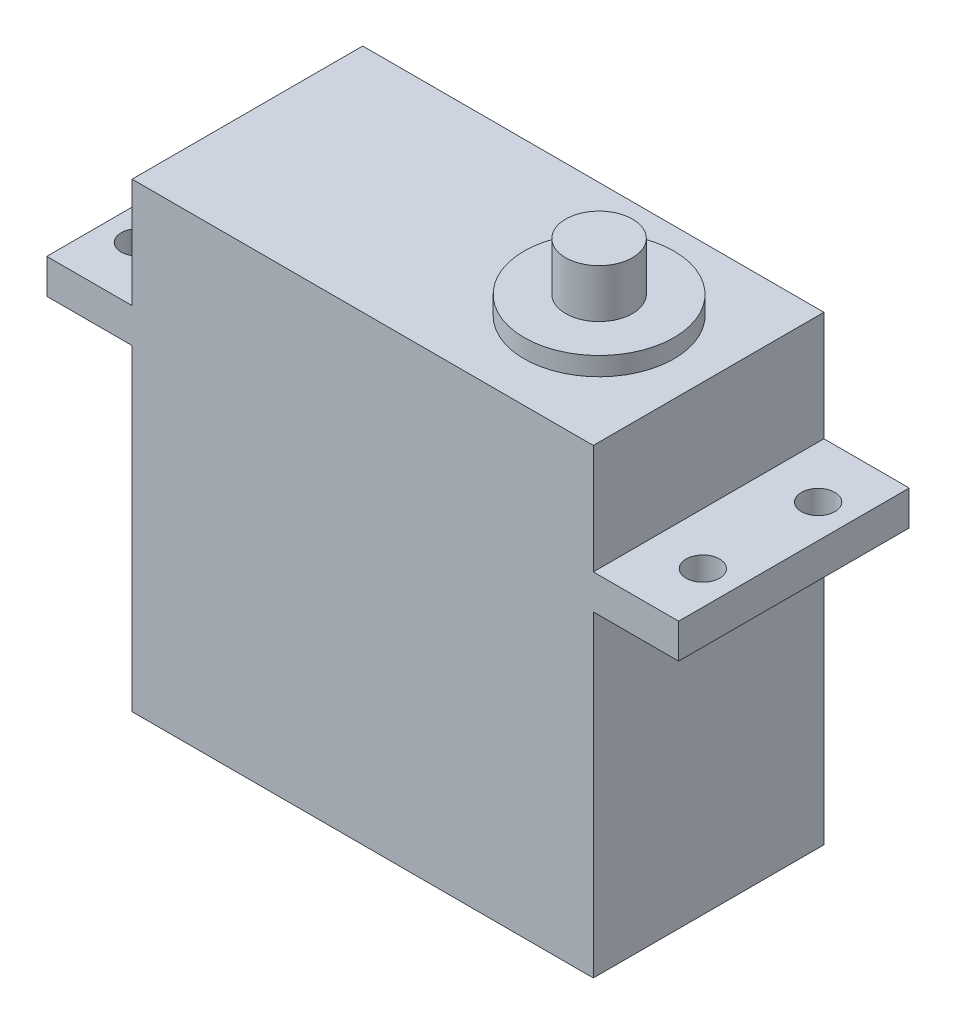
ISO-10303-21;
HEADER;
FILE_DESCRIPTION(('STEP AP214'),'2;1');
FILE_NAME('part.step','',(''),(''),'','','');
FILE_SCHEMA(('AUTOMOTIVE_DESIGN { 1 0 10303 214 1 1 1 1 }'));
ENDSEC;
DATA;
#1=APPLICATION_CONTEXT('core data for automotive mechanical design processes');
#2=APPLICATION_PROTOCOL_DEFINITION('international standard','automotive_design',2000,#1);
#3=PRODUCT_CONTEXT('',#1,'mechanical');
#4=PRODUCT('Part','Part','',(#3));
#5=PRODUCT_RELATED_PRODUCT_CATEGORY('part','',(#4));
#6=PRODUCT_DEFINITION_FORMATION('','',#4);
#7=PRODUCT_DEFINITION_CONTEXT('part definition',#1,'design');
#8=PRODUCT_DEFINITION('design','',#6,#7);
#9=PRODUCT_DEFINITION_SHAPE('','',#8);
#10=(LENGTH_UNIT() NAMED_UNIT(*) SI_UNIT(.MILLI.,.METRE.));
#11=(NAMED_UNIT(*) PLANE_ANGLE_UNIT() SI_UNIT($,.RADIAN.));
#12=(NAMED_UNIT(*) SI_UNIT($,.STERADIAN.) SOLID_ANGLE_UNIT());
#13=UNCERTAINTY_MEASURE_WITH_UNIT(LENGTH_MEASURE(1.E-05),#10,'distance_accuracy_value','');
#14=(GEOMETRIC_REPRESENTATION_CONTEXT(3) GLOBAL_UNCERTAINTY_ASSIGNED_CONTEXT((#13)) GLOBAL_UNIT_ASSIGNED_CONTEXT((#10,
#11,#12)) REPRESENTATION_CONTEXT('',''));
#15=CARTESIAN_POINT('',(0.,0.,0.));
#16=DIRECTION('',(0.,0.,1.));
#17=DIRECTION('',(1.,0.,0.));
#18=AXIS2_PLACEMENT_3D('',#15,#16,#17);
#19=CARTESIAN_POINT('',(-20.,40.,10.));
#20=DIRECTION('',(1.,0.,0.));
#21=DIRECTION('',(0.,0.,-1.));
#22=AXIS2_PLACEMENT_3D('',#19,#20,#21);
#23=PLANE('',#22);
#24=DIRECTION('',(0.,-1.,0.));
#25=VECTOR('',#24,1.);
#26=CARTESIAN_POINT('',(-20.,40.,10.));
#27=LINE('',#26,#25);
#28=CARTESIAN_POINT('',(-20.,27.5,10.));
#29=VERTEX_POINT('',#28);
#30=CARTESIAN_POINT('',(-20.,0.,10.));
#31=VERTEX_POINT('',#30);
#32=EDGE_CURVE('E211',#29,#31,#27,.T.);
#33=ORIENTED_EDGE('',*,*,#32,.F.);
#34=DIRECTION('',(0.,0.,-1.));
#35=VECTOR('',#34,1.);
#36=CARTESIAN_POINT('',(-20.,27.5,10.));
#37=LINE('',#36,#35);
#38=CARTESIAN_POINT('',(-20.,27.5,-10.));
#39=VERTEX_POINT('',#38);
#40=EDGE_CURVE('E144',#29,#39,#37,.T.);
#41=ORIENTED_EDGE('',*,*,#40,.T.);
#42=DIRECTION('',(0.,-1.,0.));
#43=VECTOR('',#42,1.);
#44=CARTESIAN_POINT('',(-20.,40.,-10.));
#45=LINE('',#44,#43);
#46=CARTESIAN_POINT('',(-20.,0.,-10.));
#47=VERTEX_POINT('',#46);
#48=EDGE_CURVE('E213',#39,#47,#45,.T.);
#49=ORIENTED_EDGE('',*,*,#48,.T.);
#50=DIRECTION('',(0.,0.,1.));
#51=VECTOR('',#50,1.);
#52=CARTESIAN_POINT('',(-20.,0.,10.));
#53=LINE('',#52,#51);
#54=EDGE_CURVE('E205',#47,#31,#53,.T.);
#55=ORIENTED_EDGE('',*,*,#54,.T.);
#56=EDGE_LOOP('',(#33,#41,#49,#55));
#57=FACE_BOUND('',#56,.T.);
#58=ADVANCED_FACE('F34',(#57),#23,.F.);
#59=CARTESIAN_POINT('',(20.,40.,10.));
#60=DIRECTION('',(-1.,0.,0.));
#61=DIRECTION('',(0.,0.,1.));
#62=AXIS2_PLACEMENT_3D('',#59,#60,#61);
#63=PLANE('',#62);
#64=DIRECTION('',(0.,0.,1.));
#65=VECTOR('',#64,1.);
#66=CARTESIAN_POINT('',(20.,30.5,10.));
#67=LINE('',#66,#65);
#68=CARTESIAN_POINT('',(20.,30.5,-10.));
#69=VERTEX_POINT('',#68);
#70=CARTESIAN_POINT('',(20.,30.5,10.));
#71=VERTEX_POINT('',#70);
#72=EDGE_CURVE('E167',#69,#71,#67,.T.);
#73=ORIENTED_EDGE('',*,*,#72,.F.);
#74=DIRECTION('',(0.,-1.,0.));
#75=VECTOR('',#74,1.);
#76=CARTESIAN_POINT('',(20.,40.,-10.));
#77=LINE('',#76,#75);
#78=CARTESIAN_POINT('',(20.,40.,-10.));
#79=VERTEX_POINT('',#78);
#80=EDGE_CURVE('E43',#79,#69,#77,.T.);
#81=ORIENTED_EDGE('',*,*,#80,.F.);
#82=DIRECTION('',(0.,0.,-1.));
#83=VECTOR('',#82,1.);
#84=CARTESIAN_POINT('',(20.,40.,10.));
#85=LINE('',#84,#83);
#86=CARTESIAN_POINT('',(20.,40.,10.));
#87=VERTEX_POINT('',#86);
#88=EDGE_CURVE('E189',#87,#79,#85,.T.);
#89=ORIENTED_EDGE('',*,*,#88,.F.);
#90=DIRECTION('',(0.,-1.,0.));
#91=VECTOR('',#90,1.);
#92=CARTESIAN_POINT('',(20.,40.,10.));
#93=LINE('',#92,#91);
#94=EDGE_CURVE('E209',#87,#71,#93,.T.);
#95=ORIENTED_EDGE('',*,*,#94,.T.);
#96=EDGE_LOOP('',(#73,#81,#89,#95));
#97=FACE_BOUND('',#96,.T.);
#98=ADVANCED_FACE('F36',(#97),#63,.F.);
#99=DIRECTION('',(0.,0.,-1.));
#100=VECTOR('',#99,1.);
#101=CARTESIAN_POINT('',(20.,27.5,10.));
#102=LINE('',#101,#100);
#103=CARTESIAN_POINT('',(20.,27.5,10.));
#104=VERTEX_POINT('',#103);
#105=CARTESIAN_POINT('',(20.,27.5,-10.));
#106=VERTEX_POINT('',#105);
#107=EDGE_CURVE('E59',#104,#106,#102,.T.);
#108=ORIENTED_EDGE('',*,*,#107,.F.);
#109=CARTESIAN_POINT('',(20.,0.,10.));
#110=VERTEX_POINT('',#109);
#111=EDGE_CURVE('E199',#104,#110,#93,.T.);
#112=ORIENTED_EDGE('',*,*,#111,.T.);
#113=DIRECTION('',(0.,0.,-1.));
#114=VECTOR('',#113,1.);
#115=CARTESIAN_POINT('',(20.,0.,10.));
#116=LINE('',#115,#114);
#117=CARTESIAN_POINT('',(20.,0.,-10.));
#118=VERTEX_POINT('',#117);
#119=EDGE_CURVE('E188',#110,#118,#116,.T.);
#120=ORIENTED_EDGE('',*,*,#119,.T.);
#121=EDGE_CURVE('E217',#106,#118,#77,.T.);
#122=ORIENTED_EDGE('',*,*,#121,.F.);
#123=EDGE_LOOP('',(#108,#112,#120,#122));
#124=FACE_BOUND('',#123,.T.);
#125=ADVANCED_FACE('F276',(#124),#63,.F.);
#126=CARTESIAN_POINT('',(-20.,40.,-10.));
#127=DIRECTION('',(0.,0.,1.));
#128=DIRECTION('',(1.,0.,0.));
#129=AXIS2_PLACEMENT_3D('',#126,#127,#128);
#130=PLANE('',#129);
#131=DIRECTION('',(-1.,0.,0.));
#132=VECTOR('',#131,1.);
#133=CARTESIAN_POINT('',(-20.,0.,-10.));
#134=LINE('',#133,#132);
#135=EDGE_CURVE('E202',#118,#47,#134,.T.);
#136=ORIENTED_EDGE('',*,*,#135,.T.);
#137=ORIENTED_EDGE('',*,*,#48,.F.);
#138=DIRECTION('',(1.,0.,0.));
#139=VECTOR('',#138,1.);
#140=CARTESIAN_POINT('',(-27.4,27.5,-10.));
#141=LINE('',#140,#139);
#142=CARTESIAN_POINT('',(-27.4,27.5,-10.));
#143=VERTEX_POINT('',#142);
#144=EDGE_CURVE('E160',#143,#39,#141,.T.);
#145=ORIENTED_EDGE('',*,*,#144,.F.);
#146=DIRECTION('',(0.,1.,0.));
#147=VECTOR('',#146,1.);
#148=CARTESIAN_POINT('',(-27.4,30.5,-10.));
#149=LINE('',#148,#147);
#150=CARTESIAN_POINT('',(-27.4,30.5,-10.));
#151=VERTEX_POINT('',#150);
#152=EDGE_CURVE('E147',#143,#151,#149,.T.);
#153=ORIENTED_EDGE('',*,*,#152,.T.);
#154=DIRECTION('',(1.,0.,0.));
#155=VECTOR('',#154,1.);
#156=CARTESIAN_POINT('',(-27.4,30.5,-10.));
#157=LINE('',#156,#155);
#158=CARTESIAN_POINT('',(-20.,30.5,-10.));
#159=VERTEX_POINT('',#158);
#160=EDGE_CURVE('E134',#151,#159,#157,.T.);
#161=ORIENTED_EDGE('',*,*,#160,.T.);
#162=CARTESIAN_POINT('',(-20.,40.,-10.));
#163=VERTEX_POINT('',#162);
#164=EDGE_CURVE('E214',#163,#159,#45,.T.);
#165=ORIENTED_EDGE('',*,*,#164,.F.);
#166=DIRECTION('',(-1.,0.,0.));
#167=VECTOR('',#166,1.);
#168=CARTESIAN_POINT('',(-20.,40.,-10.));
#169=LINE('',#168,#167);
#170=EDGE_CURVE('E192',#79,#163,#169,.T.);
#171=ORIENTED_EDGE('',*,*,#170,.F.);
#172=ORIENTED_EDGE('',*,*,#80,.T.);
#173=DIRECTION('',(-1.,0.,0.));
#174=VECTOR('',#173,1.);
#175=CARTESIAN_POINT('',(27.4,30.5,-10.));
#176=LINE('',#175,#174);
#177=CARTESIAN_POINT('',(27.4,30.5,-10.));
#178=VERTEX_POINT('',#177);
#179=EDGE_CURVE('E179',#178,#69,#176,.T.);
#180=ORIENTED_EDGE('',*,*,#179,.F.);
#181=DIRECTION('',(0.,1.,0.));
#182=VECTOR('',#181,1.);
#183=CARTESIAN_POINT('',(27.4,30.5,-10.));
#184=LINE('',#183,#182);
#185=CARTESIAN_POINT('',(27.4,27.5,-10.));
#186=VERTEX_POINT('',#185);
#187=EDGE_CURVE('E169',#186,#178,#184,.T.);
#188=ORIENTED_EDGE('',*,*,#187,.F.);
#189=DIRECTION('',(-1.,0.,0.));
#190=VECTOR('',#189,1.);
#191=CARTESIAN_POINT('',(27.4,27.5,-10.));
#192=LINE('',#191,#190);
#193=EDGE_CURVE('E182',#186,#106,#192,.T.);
#194=ORIENTED_EDGE('',*,*,#193,.T.);
#195=ORIENTED_EDGE('',*,*,#121,.T.);
#196=EDGE_LOOP('',(#136,#137,#145,#153,#161,#165,#171,#172,#180,#188,#194,#195));
#197=FACE_BOUND('',#196,.T.);
#198=ADVANCED_FACE('F281',(#197),#130,.F.);
#199=ORIENTED_EDGE('',*,*,#164,.T.);
#200=DIRECTION('',(0.,0.,1.));
#201=VECTOR('',#200,1.);
#202=CARTESIAN_POINT('',(-20.,30.5,10.));
#203=LINE('',#202,#201);
#204=CARTESIAN_POINT('',(-20.,30.5,10.));
#205=VERTEX_POINT('',#204);
#206=EDGE_CURVE('E154',#159,#205,#203,.T.);
#207=ORIENTED_EDGE('',*,*,#206,.T.);
#208=CARTESIAN_POINT('',(-20.,40.,10.));
#209=VERTEX_POINT('',#208);
#210=EDGE_CURVE('E133',#209,#205,#27,.T.);
#211=ORIENTED_EDGE('',*,*,#210,.F.);
#212=DIRECTION('',(0.,0.,1.));
#213=VECTOR('',#212,1.);
#214=CARTESIAN_POINT('',(-20.,40.,10.));
#215=LINE('',#214,#213);
#216=EDGE_CURVE('E195',#163,#209,#215,.T.);
#217=ORIENTED_EDGE('',*,*,#216,.F.);
#218=EDGE_LOOP('',(#199,#207,#211,#217));
#219=FACE_BOUND('',#218,.T.);
#220=ADVANCED_FACE('F272',(#219),#23,.F.);
#221=CARTESIAN_POINT('',(-20.,40.,10.));
#222=DIRECTION('',(0.,0.,-1.));
#223=DIRECTION('',(-1.,0.,0.));
#224=AXIS2_PLACEMENT_3D('',#221,#222,#223);
#225=PLANE('',#224);
#226=DIRECTION('',(1.,0.,0.));
#227=VECTOR('',#226,1.);
#228=CARTESIAN_POINT('',(-20.,0.,10.));
#229=LINE('',#228,#227);
#230=EDGE_CURVE('E193',#31,#110,#229,.T.);
#231=ORIENTED_EDGE('',*,*,#230,.T.);
#232=ORIENTED_EDGE('',*,*,#111,.F.);
#233=DIRECTION('',(-1.,0.,0.));
#234=VECTOR('',#233,1.);
#235=CARTESIAN_POINT('',(27.4,27.5,10.));
#236=LINE('',#235,#234);
#237=CARTESIAN_POINT('',(27.4,27.5,10.));
#238=VERTEX_POINT('',#237);
#239=EDGE_CURVE('E185',#238,#104,#236,.T.);
#240=ORIENTED_EDGE('',*,*,#239,.F.);
#241=DIRECTION('',(0.,-1.,0.));
#242=VECTOR('',#241,1.);
#243=CARTESIAN_POINT('',(27.4,30.5,10.));
#244=LINE('',#243,#242);
#245=CARTESIAN_POINT('',(27.4,30.5,10.));
#246=VERTEX_POINT('',#245);
#247=EDGE_CURVE('E163',#246,#238,#244,.T.);
#248=ORIENTED_EDGE('',*,*,#247,.F.);
#249=DIRECTION('',(-1.,0.,0.));
#250=VECTOR('',#249,1.);
#251=CARTESIAN_POINT('',(27.4,30.5,10.));
#252=LINE('',#251,#250);
#253=EDGE_CURVE('E173',#246,#71,#252,.T.);
#254=ORIENTED_EDGE('',*,*,#253,.T.);
#255=ORIENTED_EDGE('',*,*,#94,.F.);
#256=DIRECTION('',(1.,0.,0.));
#257=VECTOR('',#256,1.);
#258=CARTESIAN_POINT('',(-20.,40.,10.));
#259=LINE('',#258,#257);
#260=EDGE_CURVE('E197',#209,#87,#259,.T.);
#261=ORIENTED_EDGE('',*,*,#260,.F.);
#262=ORIENTED_EDGE('',*,*,#210,.T.);
#263=DIRECTION('',(1.,0.,0.));
#264=VECTOR('',#263,1.);
#265=CARTESIAN_POINT('',(-27.4,30.5,10.));
#266=LINE('',#265,#264);
#267=CARTESIAN_POINT('',(-27.4,30.5,10.));
#268=VERTEX_POINT('',#267);
#269=EDGE_CURVE('E51',#268,#205,#266,.T.);
#270=ORIENTED_EDGE('',*,*,#269,.F.);
#271=DIRECTION('',(0.,-1.,0.));
#272=VECTOR('',#271,1.);
#273=CARTESIAN_POINT('',(-27.4,30.5,10.));
#274=LINE('',#273,#272);
#275=CARTESIAN_POINT('',(-27.4,27.5,10.));
#276=VERTEX_POINT('',#275);
#277=EDGE_CURVE('E129',#268,#276,#274,.T.);
#278=ORIENTED_EDGE('',*,*,#277,.T.);
#279=DIRECTION('',(1.,0.,0.));
#280=VECTOR('',#279,1.);
#281=CARTESIAN_POINT('',(-27.4,27.5,10.));
#282=LINE('',#281,#280);
#283=EDGE_CURVE('E153',#276,#29,#282,.T.);
#284=ORIENTED_EDGE('',*,*,#283,.T.);
#285=ORIENTED_EDGE('',*,*,#32,.T.);
#286=EDGE_LOOP('',(#231,#232,#240,#248,#254,#255,#261,#262,#270,#278,#284,#285));
#287=FACE_BOUND('',#286,.T.);
#288=ADVANCED_FACE('F128',(#287),#225,.F.);
#289=CARTESIAN_POINT('',(0.,40.,0.));
#290=DIRECTION('',(0.,-1.,0.));
#291=DIRECTION('',(0.,0.,-1.));
#292=AXIS2_PLACEMENT_3D('',#289,#290,#291);
#293=PLANE('',#292);
#294=CARTESIAN_POINT('',(10.5,40.,0.));
#295=DIRECTION('',(0.,-1.,0.));
#296=DIRECTION('',(0.,0.,-1.));
#297=AXIS2_PLACEMENT_3D('',#294,#295,#296);
#298=CIRCLE('',#297,6.5);
#299=CARTESIAN_POINT('',(10.5,40.,-6.5));
#300=VERTEX_POINT('',#299);
#301=EDGE_CURVE('E11',#300,#300,#298,.F.);
#302=ORIENTED_EDGE('',*,*,#301,.F.);
#303=EDGE_LOOP('',(#302));
#304=FACE_BOUND('',#303,.T.);
#305=ORIENTED_EDGE('',*,*,#88,.T.);
#306=ORIENTED_EDGE('',*,*,#170,.T.);
#307=ORIENTED_EDGE('',*,*,#216,.T.);
#308=ORIENTED_EDGE('',*,*,#260,.T.);
#309=EDGE_LOOP('',(#305,#306,#307,#308));
#310=FACE_BOUND('',#309,.T.);
#311=ADVANCED_FACE('F287',(#304,#310),#293,.F.);
#312=CARTESIAN_POINT('',(0.,0.,0.));
#313=DIRECTION('',(0.,-1.,0.));
#314=DIRECTION('',(0.,0.,-1.));
#315=AXIS2_PLACEMENT_3D('',#312,#313,#314);
#316=PLANE('',#315);
#317=ORIENTED_EDGE('',*,*,#119,.F.);
#318=ORIENTED_EDGE('',*,*,#230,.F.);
#319=ORIENTED_EDGE('',*,*,#54,.F.);
#320=ORIENTED_EDGE('',*,*,#135,.F.);
#321=EDGE_LOOP('',(#317,#318,#319,#320));
#322=FACE_BOUND('',#321,.T.);
#323=ADVANCED_FACE('F300',(#322),#316,.T.);
#324=CARTESIAN_POINT('',(27.4,27.5,10.));
#325=DIRECTION('',(0.,1.,0.));
#326=DIRECTION('',(0.,0.,1.));
#327=AXIS2_PLACEMENT_3D('',#324,#325,#326);
#328=PLANE('',#327);
#329=CARTESIAN_POINT('',(24.5000000000001,27.5,-4.99999999999964));
#330=DIRECTION('',(0.,1.,0.));
#331=DIRECTION('',(0.,0.,1.));
#332=AXIS2_PLACEMENT_3D('',#329,#330,#331);
#333=CIRCLE('',#332,1.45);
#334=CARTESIAN_POINT('',(24.5000000000001,27.5,-3.54999999999965));
#335=VERTEX_POINT('',#334);
#336=EDGE_CURVE('E230',#335,#335,#333,.T.);
#337=ORIENTED_EDGE('',*,*,#336,.T.);
#338=EDGE_LOOP('',(#337));
#339=FACE_BOUND('',#338,.T.);
#340=CARTESIAN_POINT('',(24.5000000000002,27.5,5.00000000000035));
#341=DIRECTION('',(0.,1.,0.));
#342=DIRECTION('',(0.,0.,1.));
#343=AXIS2_PLACEMENT_3D('',#340,#341,#342);
#344=CIRCLE('',#343,1.45);
#345=CARTESIAN_POINT('',(24.5000000000002,27.5,6.45000000000035));
#346=VERTEX_POINT('',#345);
#347=EDGE_CURVE('E245',#346,#346,#344,.T.);
#348=ORIENTED_EDGE('',*,*,#347,.T.);
#349=EDGE_LOOP('',(#348));
#350=FACE_BOUND('',#349,.T.);
#351=ORIENTED_EDGE('',*,*,#107,.T.);
#352=ORIENTED_EDGE('',*,*,#193,.F.);
#353=DIRECTION('',(0.,0.,-1.));
#354=VECTOR('',#353,1.);
#355=CARTESIAN_POINT('',(27.4,27.5,10.));
#356=LINE('',#355,#354);
#357=EDGE_CURVE('E166',#238,#186,#356,.T.);
#358=ORIENTED_EDGE('',*,*,#357,.F.);
#359=ORIENTED_EDGE('',*,*,#239,.T.);
#360=EDGE_LOOP('',(#351,#352,#358,#359));
#361=FACE_BOUND('',#360,.T.);
#362=ADVANCED_FACE('F304',(#339,#350,#361),#328,.F.);
#363=CARTESIAN_POINT('',(27.4,30.5,10.));
#364=DIRECTION('',(0.,-1.,0.));
#365=DIRECTION('',(0.,0.,-1.));
#366=AXIS2_PLACEMENT_3D('',#363,#364,#365);
#367=PLANE('',#366);
#368=CARTESIAN_POINT('',(24.5000000000001,30.5,-4.99999999999964));
#369=DIRECTION('',(0.,1.,0.));
#370=DIRECTION('',(0.,0.,1.));
#371=AXIS2_PLACEMENT_3D('',#368,#369,#370);
#372=CIRCLE('',#371,1.45);
#373=CARTESIAN_POINT('',(24.5000000000001,30.5,-3.54999999999964));
#374=VERTEX_POINT('',#373);
#375=EDGE_CURVE('E225',#374,#374,#372,.T.);
#376=ORIENTED_EDGE('',*,*,#375,.F.);
#377=EDGE_LOOP('',(#376));
#378=FACE_BOUND('',#377,.T.);
#379=CARTESIAN_POINT('',(24.5000000000002,30.5,5.00000000000035));
#380=DIRECTION('',(0.,1.,0.));
#381=DIRECTION('',(0.,0.,1.));
#382=AXIS2_PLACEMENT_3D('',#379,#380,#381);
#383=CIRCLE('',#382,1.45);
#384=CARTESIAN_POINT('',(24.5000000000002,30.5,6.45000000000035));
#385=VERTEX_POINT('',#384);
#386=EDGE_CURVE('E242',#385,#385,#383,.T.);
#387=ORIENTED_EDGE('',*,*,#386,.F.);
#388=EDGE_LOOP('',(#387));
#389=FACE_BOUND('',#388,.T.);
#390=ORIENTED_EDGE('',*,*,#72,.T.);
#391=ORIENTED_EDGE('',*,*,#253,.F.);
#392=DIRECTION('',(0.,0.,1.));
#393=VECTOR('',#392,1.);
#394=CARTESIAN_POINT('',(27.4,30.5,10.));
#395=LINE('',#394,#393);
#396=EDGE_CURVE('E171',#178,#246,#395,.T.);
#397=ORIENTED_EDGE('',*,*,#396,.F.);
#398=ORIENTED_EDGE('',*,*,#179,.T.);
#399=EDGE_LOOP('',(#390,#391,#397,#398));
#400=FACE_BOUND('',#399,.T.);
#401=ADVANCED_FACE('F314',(#378,#389,#400),#367,.F.);
#402=CARTESIAN_POINT('',(27.4,0.,0.));
#403=DIRECTION('',(1.,0.,0.));
#404=DIRECTION('',(0.,0.,-1.));
#405=AXIS2_PLACEMENT_3D('',#402,#403,#404);
#406=PLANE('',#405);
#407=ORIENTED_EDGE('',*,*,#247,.T.);
#408=ORIENTED_EDGE('',*,*,#357,.T.);
#409=ORIENTED_EDGE('',*,*,#187,.T.);
#410=ORIENTED_EDGE('',*,*,#396,.T.);
#411=EDGE_LOOP('',(#407,#408,#409,#410));
#412=FACE_BOUND('',#411,.T.);
#413=ADVANCED_FACE('F308',(#412),#406,.T.);
#414=CARTESIAN_POINT('',(-27.4,30.5,10.));
#415=DIRECTION('',(0.,1.,0.));
#416=DIRECTION('',(0.,0.,1.));
#417=AXIS2_PLACEMENT_3D('',#414,#415,#416);
#418=PLANE('',#417);
#419=CARTESIAN_POINT('',(-24.4999999999999,30.5,-4.99999999999964));
#420=DIRECTION('',(0.,1.,0.));
#421=DIRECTION('',(0.,0.,1.));
#422=AXIS2_PLACEMENT_3D('',#419,#420,#421);
#423=CIRCLE('',#422,1.45);
#424=CARTESIAN_POINT('',(-24.4999999999999,30.5,-3.54999999999964));
#425=VERTEX_POINT('',#424);
#426=EDGE_CURVE('E237',#425,#425,#423,.T.);
#427=ORIENTED_EDGE('',*,*,#426,.F.);
#428=EDGE_LOOP('',(#427));
#429=FACE_BOUND('',#428,.T.);
#430=CARTESIAN_POINT('',(-24.4999999999999,30.5,5.00000000000038));
#431=DIRECTION('',(0.,1.,0.));
#432=DIRECTION('',(0.,0.,1.));
#433=AXIS2_PLACEMENT_3D('',#430,#431,#432);
#434=CIRCLE('',#433,1.45);
#435=CARTESIAN_POINT('',(-24.4999999999999,30.5,6.45000000000038));
#436=VERTEX_POINT('',#435);
#437=EDGE_CURVE('E226',#436,#436,#434,.T.);
#438=ORIENTED_EDGE('',*,*,#437,.F.);
#439=EDGE_LOOP('',(#438));
#440=FACE_BOUND('',#439,.T.);
#441=ORIENTED_EDGE('',*,*,#206,.F.);
#442=ORIENTED_EDGE('',*,*,#160,.F.);
#443=DIRECTION('',(0.,0.,1.));
#444=VECTOR('',#443,1.);
#445=CARTESIAN_POINT('',(-27.4,30.5,10.));
#446=LINE('',#445,#444);
#447=EDGE_CURVE('E140',#151,#268,#446,.T.);
#448=ORIENTED_EDGE('',*,*,#447,.T.);
#449=ORIENTED_EDGE('',*,*,#269,.T.);
#450=EDGE_LOOP('',(#441,#442,#448,#449));
#451=FACE_BOUND('',#450,.T.);
#452=ADVANCED_FACE('F146',(#429,#440,#451),#418,.T.);
#453=CARTESIAN_POINT('',(-27.4,27.5,10.));
#454=DIRECTION('',(0.,-1.,0.));
#455=DIRECTION('',(0.,0.,-1.));
#456=AXIS2_PLACEMENT_3D('',#453,#454,#455);
#457=PLANE('',#456);
#458=CARTESIAN_POINT('',(-24.4999999999999,27.5,-4.99999999999964));
#459=DIRECTION('',(0.,-1.,0.));
#460=DIRECTION('',(0.,0.,-1.));
#461=AXIS2_PLACEMENT_3D('',#458,#459,#460);
#462=CIRCLE('',#461,1.45);
#463=CARTESIAN_POINT('',(-24.4999999999999,27.5,-6.44999999999964));
#464=VERTEX_POINT('',#463);
#465=EDGE_CURVE('E38',#464,#464,#462,.T.);
#466=ORIENTED_EDGE('',*,*,#465,.F.);
#467=EDGE_LOOP('',(#466));
#468=FACE_BOUND('',#467,.T.);
#469=CARTESIAN_POINT('',(-24.4999999999999,27.5,5.00000000000038));
#470=DIRECTION('',(0.,-1.,0.));
#471=DIRECTION('',(0.,0.,-1.));
#472=AXIS2_PLACEMENT_3D('',#469,#470,#471);
#473=CIRCLE('',#472,1.45);
#474=CARTESIAN_POINT('',(-24.4999999999999,27.5,3.55000000000038));
#475=VERTEX_POINT('',#474);
#476=EDGE_CURVE('E223',#475,#475,#473,.T.);
#477=ORIENTED_EDGE('',*,*,#476,.F.);
#478=EDGE_LOOP('',(#477));
#479=FACE_BOUND('',#478,.T.);
#480=ORIENTED_EDGE('',*,*,#40,.F.);
#481=ORIENTED_EDGE('',*,*,#283,.F.);
#482=DIRECTION('',(0.,0.,-1.));
#483=VECTOR('',#482,1.);
#484=CARTESIAN_POINT('',(-27.4,27.5,10.));
#485=LINE('',#484,#483);
#486=EDGE_CURVE('E143',#276,#143,#485,.T.);
#487=ORIENTED_EDGE('',*,*,#486,.T.);
#488=ORIENTED_EDGE('',*,*,#144,.T.);
#489=EDGE_LOOP('',(#480,#481,#487,#488));
#490=FACE_BOUND('',#489,.T.);
#491=ADVANCED_FACE('F294',(#468,#479,#490),#457,.T.);
#492=CARTESIAN_POINT('',(-27.4,0.,0.));
#493=DIRECTION('',(-1.,0.,0.));
#494=DIRECTION('',(0.,0.,-1.));
#495=AXIS2_PLACEMENT_3D('',#492,#493,#494);
#496=PLANE('',#495);
#497=ORIENTED_EDGE('',*,*,#277,.F.);
#498=ORIENTED_EDGE('',*,*,#447,.F.);
#499=ORIENTED_EDGE('',*,*,#152,.F.);
#500=ORIENTED_EDGE('',*,*,#486,.F.);
#501=EDGE_LOOP('',(#497,#498,#499,#500));
#502=FACE_BOUND('',#501,.T.);
#503=ADVANCED_FACE('F138',(#502),#496,.T.);
#504=CARTESIAN_POINT('',(10.5,41.6,0.));
#505=DIRECTION('',(0.,-1.,0.));
#506=DIRECTION('',(0.,0.,-1.));
#507=AXIS2_PLACEMENT_3D('',#504,#505,#506);
#508=CYLINDRICAL_SURFACE('',#507,6.5);
#509=CARTESIAN_POINT('',(10.5,41.6,0.));
#510=DIRECTION('',(0.,1.,0.));
#511=DIRECTION('',(0.,0.,1.));
#512=AXIS2_PLACEMENT_3D('',#509,#510,#511);
#513=CIRCLE('',#512,6.5);
#514=CARTESIAN_POINT('',(10.5,41.6,6.5));
#515=VERTEX_POINT('',#514);
#516=EDGE_CURVE('E222',#515,#515,#513,.T.);
#517=ORIENTED_EDGE('',*,*,#516,.F.);
#518=EDGE_LOOP('',(#517));
#519=FACE_BOUND('',#518,.T.);
#520=ORIENTED_EDGE('',*,*,#301,.T.);
#521=EDGE_LOOP('',(#520));
#522=FACE_BOUND('',#521,.T.);
#523=ADVANCED_FACE('F341',(#519,#522),#508,.T.);
#524=CARTESIAN_POINT('',(10.5,41.6,0.));
#525=DIRECTION('',(0.,1.,0.));
#526=DIRECTION('',(0.,0.,1.));
#527=AXIS2_PLACEMENT_3D('',#524,#525,#526);
#528=PLANE('',#527);
#529=CARTESIAN_POINT('',(10.5,41.6,0.));
#530=DIRECTION('',(0.,1.,0.));
#531=DIRECTION('',(0.,0.,1.));
#532=AXIS2_PLACEMENT_3D('',#529,#530,#531);
#533=CIRCLE('',#532,2.9);
#534=CARTESIAN_POINT('',(10.5,41.6,2.9));
#535=VERTEX_POINT('',#534);
#536=EDGE_CURVE('E220',#535,#535,#533,.T.);
#537=ORIENTED_EDGE('',*,*,#536,.F.);
#538=EDGE_LOOP('',(#537));
#539=FACE_BOUND('',#538,.T.);
#540=ORIENTED_EDGE('',*,*,#516,.T.);
#541=EDGE_LOOP('',(#540));
#542=FACE_BOUND('',#541,.T.);
#543=ADVANCED_FACE('F266',(#539,#542),#528,.T.);
#544=CARTESIAN_POINT('',(10.5,45.8,0.));
#545=DIRECTION('',(0.,1.,0.));
#546=DIRECTION('',(0.,0.,1.));
#547=AXIS2_PLACEMENT_3D('',#544,#545,#546);
#548=PLANE('',#547);
#549=CARTESIAN_POINT('',(10.5,45.8,0.));
#550=DIRECTION('',(0.,1.,0.));
#551=DIRECTION('',(0.,0.,1.));
#552=AXIS2_PLACEMENT_3D('',#549,#550,#551);
#553=CIRCLE('',#552,2.9);
#554=CARTESIAN_POINT('',(10.5,45.8,2.9));
#555=VERTEX_POINT('',#554);
#556=EDGE_CURVE('E156',#555,#555,#553,.T.);
#557=ORIENTED_EDGE('',*,*,#556,.T.);
#558=EDGE_LOOP('',(#557));
#559=FACE_BOUND('',#558,.T.);
#560=ADVANCED_FACE('F252',(#559),#548,.T.);
#561=CARTESIAN_POINT('',(10.5,45.8,0.));
#562=DIRECTION('',(0.,-1.,0.));
#563=DIRECTION('',(0.,0.,-1.));
#564=AXIS2_PLACEMENT_3D('',#561,#562,#563);
#565=CYLINDRICAL_SURFACE('',#564,2.9);
#566=ORIENTED_EDGE('',*,*,#536,.T.);
#567=EDGE_LOOP('',(#566));
#568=FACE_BOUND('',#567,.T.);
#569=ORIENTED_EDGE('',*,*,#556,.F.);
#570=EDGE_LOOP('',(#569));
#571=FACE_BOUND('',#570,.T.);
#572=ADVANCED_FACE('F254',(#568,#571),#565,.T.);
#573=CARTESIAN_POINT('',(24.5000000000002,30.5,5.00000000000035));
#574=DIRECTION('',(0.,1.,0.));
#575=DIRECTION('',(0.,0.,1.));
#576=AXIS2_PLACEMENT_3D('',#573,#574,#575);
#577=CYLINDRICAL_SURFACE('',#576,1.45);
#578=ORIENTED_EDGE('',*,*,#386,.T.);
#579=EDGE_LOOP('',(#578));
#580=FACE_BOUND('',#579,.T.);
#581=ORIENTED_EDGE('',*,*,#347,.F.);
#582=EDGE_LOOP('',(#581));
#583=FACE_BOUND('',#582,.T.);
#584=ADVANCED_FACE('F256',(#580,#583),#577,.F.);
#585=CARTESIAN_POINT('',(24.5000000000001,30.5,-4.99999999999964));
#586=DIRECTION('',(0.,1.,0.));
#587=DIRECTION('',(0.,0.,1.));
#588=AXIS2_PLACEMENT_3D('',#585,#586,#587);
#589=CYLINDRICAL_SURFACE('',#588,1.45);
#590=ORIENTED_EDGE('',*,*,#375,.T.);
#591=EDGE_LOOP('',(#590));
#592=FACE_BOUND('',#591,.T.);
#593=ORIENTED_EDGE('',*,*,#336,.F.);
#594=EDGE_LOOP('',(#593));
#595=FACE_BOUND('',#594,.T.);
#596=ADVANCED_FACE('F263',(#592,#595),#589,.F.);
#597=CARTESIAN_POINT('',(-24.4999999999999,30.5,5.00000000000038));
#598=DIRECTION('',(0.,1.,0.));
#599=DIRECTION('',(0.,0.,1.));
#600=AXIS2_PLACEMENT_3D('',#597,#598,#599);
#601=CYLINDRICAL_SURFACE('',#600,1.45);
#602=ORIENTED_EDGE('',*,*,#476,.T.);
#603=EDGE_LOOP('',(#602));
#604=FACE_BOUND('',#603,.T.);
#605=ORIENTED_EDGE('',*,*,#437,.T.);
#606=EDGE_LOOP('',(#605));
#607=FACE_BOUND('',#606,.T.);
#608=ADVANCED_FACE('F357',(#604,#607),#601,.F.);
#609=CARTESIAN_POINT('',(-24.4999999999999,30.5,-4.99999999999964));
#610=DIRECTION('',(0.,1.,0.));
#611=DIRECTION('',(0.,0.,1.));
#612=AXIS2_PLACEMENT_3D('',#609,#610,#611);
#613=CYLINDRICAL_SURFACE('',#612,1.45);
#614=ORIENTED_EDGE('',*,*,#465,.T.);
#615=EDGE_LOOP('',(#614));
#616=FACE_BOUND('',#615,.T.);
#617=ORIENTED_EDGE('',*,*,#426,.T.);
#618=EDGE_LOOP('',(#617));
#619=FACE_BOUND('',#618,.T.);
#620=ADVANCED_FACE('F361',(#616,#619),#613,.F.);
#621=CLOSED_SHELL('',(#58,#98,#125,#198,#220,#288,#311,#323,#362,#401,#413,#452,#491,#503,#523,
#543,#560,#572,#584,#596,#608,#620));
#622=MANIFOLD_SOLID_BREP('B2',#621);
#623=ADVANCED_BREP_SHAPE_REPRESENTATION('',(#18,#622),#14);
#624=SHAPE_DEFINITION_REPRESENTATION(#9,#623);
ENDSEC;
END-ISO-10303-21;
